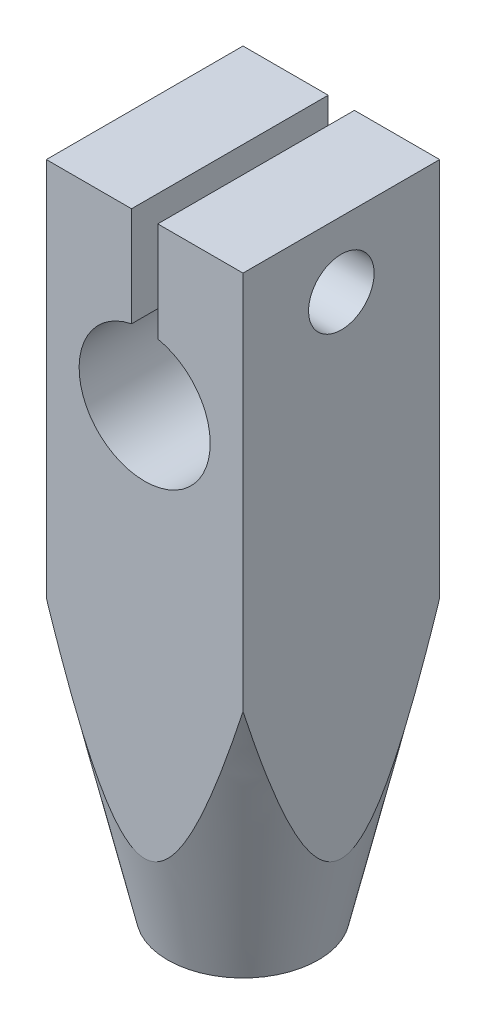
ISO-10303-21;
HEADER;
FILE_DESCRIPTION(('STEP AP214'),'2;1');
FILE_NAME('part.step','',(''),(''),'','','');
FILE_SCHEMA(('AUTOMOTIVE_DESIGN { 1 0 10303 214 1 1 1 1 }'));
ENDSEC;
DATA;
#1=APPLICATION_CONTEXT('core data for automotive mechanical design processes');
#2=APPLICATION_PROTOCOL_DEFINITION('international standard','automotive_design',2000,#1);
#3=PRODUCT_CONTEXT('',#1,'mechanical');
#4=PRODUCT('Part','Part','',(#3));
#5=PRODUCT_RELATED_PRODUCT_CATEGORY('part','',(#4));
#6=PRODUCT_DEFINITION_FORMATION('','',#4);
#7=PRODUCT_DEFINITION_CONTEXT('part definition',#1,'design');
#8=PRODUCT_DEFINITION('design','',#6,#7);
#9=PRODUCT_DEFINITION_SHAPE('','',#8);
#10=(LENGTH_UNIT() NAMED_UNIT(*) SI_UNIT(.MILLI.,.METRE.));
#11=(NAMED_UNIT(*) PLANE_ANGLE_UNIT() SI_UNIT($,.RADIAN.));
#12=(NAMED_UNIT(*) SI_UNIT($,.STERADIAN.) SOLID_ANGLE_UNIT());
#13=UNCERTAINTY_MEASURE_WITH_UNIT(LENGTH_MEASURE(1.E-05),#10,'distance_accuracy_value','');
#14=(GEOMETRIC_REPRESENTATION_CONTEXT(3) GLOBAL_UNCERTAINTY_ASSIGNED_CONTEXT((#13)) GLOBAL_UNIT_ASSIGNED_CONTEXT((#10,
#11,#12)) REPRESENTATION_CONTEXT('',''));
#15=CARTESIAN_POINT('',(0.,0.,0.));
#16=DIRECTION('',(0.,0.,1.));
#17=DIRECTION('',(1.,0.,0.));
#18=AXIS2_PLACEMENT_3D('',#15,#16,#17);
#19=CARTESIAN_POINT('',(-3.,205.,3.));
#20=DIRECTION('',(0.,-1.,0.));
#21=DIRECTION('',(0.,0.,-1.));
#22=AXIS2_PLACEMENT_3D('',#19,#20,#21);
#23=PLANE('',#22);
#24=DIRECTION('',(-1.,0.,0.));
#25=VECTOR('',#24,1.);
#26=CARTESIAN_POINT('',(-3.,205.,3.));
#27=LINE('',#26,#25);
#28=CARTESIAN_POINT('',(-0.400000000000001,205.,3.));
#29=VERTEX_POINT('',#28);
#30=CARTESIAN_POINT('',(-3.,205.,3.));
#31=VERTEX_POINT('',#30);
#32=EDGE_CURVE('E124',#29,#31,#27,.T.);
#33=ORIENTED_EDGE('',*,*,#32,.F.);
#34=DIRECTION('',(0.,0.,1.));
#35=VECTOR('',#34,1.);
#36=CARTESIAN_POINT('',(-0.400000000000001,205.,-3.58548068095813));
#37=LINE('',#36,#35);
#38=CARTESIAN_POINT('',(-0.400000000000001,205.,-3.));
#39=VERTEX_POINT('',#38);
#40=EDGE_CURVE('E116',#39,#29,#37,.T.);
#41=ORIENTED_EDGE('',*,*,#40,.F.);
#42=DIRECTION('',(-1.,0.,0.));
#43=VECTOR('',#42,1.);
#44=CARTESIAN_POINT('',(-3.,205.,-3.));
#45=LINE('',#44,#43);
#46=CARTESIAN_POINT('',(-3.,205.,-3.));
#47=VERTEX_POINT('',#46);
#48=EDGE_CURVE('E138',#39,#47,#45,.T.);
#49=ORIENTED_EDGE('',*,*,#48,.T.);
#50=DIRECTION('',(0.,0.,-1.));
#51=VECTOR('',#50,1.);
#52=CARTESIAN_POINT('',(-3.,205.,3.));
#53=LINE('',#52,#51);
#54=EDGE_CURVE('E123',#31,#47,#53,.T.);
#55=ORIENTED_EDGE('',*,*,#54,.F.);
#56=EDGE_LOOP('',(#33,#41,#49,#55));
#57=FACE_BOUND('',#56,.T.);
#58=ADVANCED_FACE('F35',(#57),#23,.F.);
#59=CARTESIAN_POINT('',(0.,0.,3.));
#60=DIRECTION('',(0.,0.,1.));
#61=DIRECTION('',(1.,0.,0.));
#62=AXIS2_PLACEMENT_3D('',#59,#60,#61);
#63=PLANE('',#62);
#64=DIRECTION('',(0.,-1.,0.));
#65=VECTOR('',#64,1.);
#66=CARTESIAN_POINT('',(-0.400000000000001,205.,3.));
#67=LINE('',#66,#65);
#68=CARTESIAN_POINT('',(-0.399999999999996,201.959591794227,3.));
#69=VERTEX_POINT('',#68);
#70=EDGE_CURVE('E59',#29,#69,#67,.T.);
#71=ORIENTED_EDGE('',*,*,#70,.F.);
#72=ORIENTED_EDGE('',*,*,#32,.T.);
#73=DIRECTION('',(0.,-1.,0.));
#74=VECTOR('',#73,1.);
#75=CARTESIAN_POINT('',(-3.,205.,3.));
#76=LINE('',#75,#74);
#77=CARTESIAN_POINT('',(-2.99999999999999,193.41450126866,3.));
#78=VERTEX_POINT('',#77);
#79=EDGE_CURVE('E139',#31,#78,#76,.T.);
#80=ORIENTED_EDGE('',*,*,#79,.T.);
#81=CARTESIAN_POINT('',(-9.01287451142703,216.182501373795,3.));
#82=CARTESIAN_POINT('',(-8.86165127865391,215.561028705235,3.));
#83=CARTESIAN_POINT('',(-8.71007949873085,214.939640636726,3.));
#84=CARTESIAN_POINT('',(-8.4060968737982,213.69706770407,3.));
#85=CARTESIAN_POINT('',(-8.25368602611668,213.075882840577,3.));
#86=CARTESIAN_POINT('',(-7.94774960641446,211.833207350189,3.));
#87=CARTESIAN_POINT('',(-7.7942231709233,211.21171693577,3.));
#88=CARTESIAN_POINT('',(-7.48600094126805,209.969027446211,3.));
#89=CARTESIAN_POINT('',(-7.33130514965128,209.34782837044,3.));
#90=CARTESIAN_POINT('',(-7.01741923952769,208.093445670033,3.));
#91=CARTESIAN_POINT('',(-6.85820088662912,207.460269105991,3.));
#92=CARTESIAN_POINT('',(-6.53797053455288,206.194369808065,3.));
#93=CARTESIAN_POINT('',(-6.37695853670778,205.561647073843,3.));
#94=CARTESIAN_POINT('',(-6.05283248344599,204.297300160195,3.));
#95=CARTESIAN_POINT('',(-5.88972028650205,203.665675504795,3.));
#96=CARTESIAN_POINT('',(-5.56066090324309,202.403177551625,3.));
#97=CARTESIAN_POINT('',(-5.39471377548291,201.772304238624,3.));
#98=CARTESIAN_POINT('',(-5.09683944336999,200.65329176169,3.));
#99=CARTESIAN_POINT('',(-4.9656531273945,200.164955578698,3.));
#100=CARTESIAN_POINT('',(-4.70046296670573,199.189013132647,3.));
#101=CARTESIAN_POINT('',(-4.56645893772648,198.701406919572,3.));
#102=CARTESIAN_POINT('',(-4.29452561978227,197.726070097895,3.));
#103=CARTESIAN_POINT('',(-4.15658795921019,197.23834181631,3.));
#104=CARTESIAN_POINT('',(-3.87592663379815,196.26437905762,3.));
#105=CARTESIAN_POINT('',(-3.73320404598431,195.778144270892,3.));
#106=CARTESIAN_POINT('',(-3.44252154652239,194.812238547251,3.));
#107=CARTESIAN_POINT('',(-3.29462394406386,194.33254902747,3.));
#108=CARTESIAN_POINT('',(-3.06558536957454,193.615075940682,3.));
#109=CARTESIAN_POINT('',(-2.98800472977996,193.376157011606,3.));
#110=CARTESIAN_POINT('',(-2.82986683715412,192.899317800469,3.));
#111=CARTESIAN_POINT('',(-2.74930974944097,192.661397463824,3.));
#112=CARTESIAN_POINT('',(-2.58476087229684,192.187852869738,3.));
#113=CARTESIAN_POINT('',(-2.50078481549463,191.952223174129,3.));
#114=CARTESIAN_POINT('',(-2.3278975916621,191.482712983951,3.));
#115=CARTESIAN_POINT('',(-2.23898529254675,191.248832904714,3.));
#116=CARTESIAN_POINT('',(-2.05461121333346,190.784032641517,3.));
#117=CARTESIAN_POINT('',(-1.9591594701316,190.553108539764,3.));
#118=CARTESIAN_POINT('',(-1.80872487133761,190.209953547973,3.));
#119=CARTESIAN_POINT('',(-1.75738117522927,190.096128853328,3.));
#120=CARTESIAN_POINT('',(-1.65166277099906,189.869900305202,3.));
#121=CARTESIAN_POINT('',(-1.5972884536239,189.757496270834,3.));
#122=CARTESIAN_POINT('',(-1.51713842542016,189.598879781359,3.));
#123=CARTESIAN_POINT('',(-1.49294703998735,189.551865605888,3.));
#124=CARTESIAN_POINT('',(-1.44378178526353,189.458244907353,3.));
#125=CARTESIAN_POINT('',(-1.4188078668044,189.411638410141,3.));
#126=CARTESIAN_POINT('',(-1.34254228970733,189.27247537057,3.));
#127=CARTESIAN_POINT('',(-1.28993427011471,189.180630200503,3.));
#128=CARTESIAN_POINT('',(-1.18009176724492,188.999494276551,3.));
#129=CARTESIAN_POINT('',(-1.12284886635755,188.910208587961,3.));
#130=CARTESIAN_POINT('',(-1.00229510043742,188.735871126595,3.));
#131=CARTESIAN_POINT('',(-0.938990933958253,188.650814834195,3.));
#132=CARTESIAN_POINT('',(-0.803008187582504,188.486436463202,3.));
#133=CARTESIAN_POINT('',(-0.73021003176836,188.407212127979,3.));
#134=CARTESIAN_POINT('',(-0.572357849866844,188.26223165786,3.));
#135=CARTESIAN_POINT('',(-0.487421956491983,188.196359013203,3.));
#136=CARTESIAN_POINT('',(-0.356238912029505,188.122304082717,3.));
#137=CARTESIAN_POINT('',(-0.316438691850352,188.10292024724,3.));
#138=CARTESIAN_POINT('',(-0.234336687293959,188.070413642556,3.));
#139=CARTESIAN_POINT('',(-0.192037744603792,188.057283909248,3.));
#140=CARTESIAN_POINT('',(-0.10528022130079,188.038670553009,3.));
#141=CARTESIAN_POINT('',(-0.060804102616985,188.033265741773,3.));
#142=CARTESIAN_POINT('',(0.0283584576351706,188.031180465067,3.));
#143=CARTESIAN_POINT('',(0.0730448694952927,188.034498802142,3.));
#144=CARTESIAN_POINT('',(0.156028177442846,188.048493531718,3.));
#145=CARTESIAN_POINT('',(0.194478951566063,188.058301518907,3.));
#146=CARTESIAN_POINT('',(0.269538368709179,188.083367098795,3.));
#147=CARTESIAN_POINT('',(0.306145915900473,188.098627890632,3.));
#148=CARTESIAN_POINT('',(0.403007581213953,188.146095063985,3.));
#149=CARTESIAN_POINT('',(0.461152416395532,188.182563570171,3.));
#150=CARTESIAN_POINT('',(0.571484021358029,188.263595271081,3.));
#151=CARTESIAN_POINT('',(0.623648930970702,188.308186713162,3.));
#152=CARTESIAN_POINT('',(0.742934425000127,188.421325672918,3.));
#153=CARTESIAN_POINT('',(0.807696117993594,188.492323275336,3.));
#154=CARTESIAN_POINT('',(0.930317531107682,188.640120648052,3.));
#155=CARTESIAN_POINT('',(0.988161030668625,188.71693339037,3.));
#156=CARTESIAN_POINT('',(1.09902342909704,188.874688114438,3.));
#157=CARTESIAN_POINT('',(1.15200793009996,188.955654023179,3.));
#158=CARTESIAN_POINT('',(1.25391236781289,189.119944605941,3.));
#159=CARTESIAN_POINT('',(1.30283693201381,189.20326644525,3.));
#160=CARTESIAN_POINT('',(1.4026005741772,189.38061538266,3.));
#161=CARTESIAN_POINT('',(1.4530895668492,189.474838306108,3.));
#162=CARTESIAN_POINT('',(1.55106094056043,189.664840538209,3.));
#163=CARTESIAN_POINT('',(1.59854286065923,189.760620082655,3.));
#164=CARTESIAN_POINT('',(1.73743176100008,190.049795449297,3.));
#165=CARTESIAN_POINT('',(1.82522521910847,190.244923701157,3.));
#166=CARTESIAN_POINT('',(1.99439311233377,190.638466096465,3.));
#167=CARTESIAN_POINT('',(2.07575111054076,190.836887181287,3.));
#168=CARTESIAN_POINT('',(2.23354308611966,191.235594988893,3.));
#169=CARTESIAN_POINT('',(2.30997865638071,191.435881083904,3.));
#170=CARTESIAN_POINT('',(2.45922107007001,191.838126167329,3.));
#171=CARTESIAN_POINT('',(2.53202243670159,192.040087175732,3.));
#172=CARTESIAN_POINT('',(2.67467387364262,192.445063460558,3.));
#173=CARTESIAN_POINT('',(2.74452371022694,192.648078819048,3.));
#174=CARTESIAN_POINT('',(2.88173091845588,193.05460503559,3.));
#175=CARTESIAN_POINT('',(2.94909190861685,193.258114675652,3.));
#176=CARTESIAN_POINT('',(3.08184582557207,193.665766278906,3.));
#177=CARTESIAN_POINT('',(3.14723881409911,193.86990822204,3.));
#178=CARTESIAN_POINT('',(3.34175953676816,194.485618571445,3.));
#179=CARTESIAN_POINT('',(3.46839573242425,194.89797404847,3.));
#180=CARTESIAN_POINT('',(3.71687360351173,195.724130395756,3.));
#181=CARTESIAN_POINT('',(3.83871514120677,196.137931307168,3.));
#182=CARTESIAN_POINT('',(4.0787647797307,196.966625871803,3.));
#183=CARTESIAN_POINT('',(4.19697253792434,197.381519624092,3.));
#184=CARTESIAN_POINT('',(4.43053752667301,198.212109747289,3.));
#185=CARTESIAN_POINT('',(4.54589473739377,198.627806123761,3.));
#186=CARTESIAN_POINT('',(4.88882619965151,199.876716791018,3.));
#187=CARTESIAN_POINT('',(5.11300550019374,200.710862688925,3.));
#188=CARTESIAN_POINT('',(5.55528745513385,202.38070609231,3.));
#189=CARTESIAN_POINT('',(5.77339043983136,203.216403510805,3.));
#190=CARTESIAN_POINT('',(6.19794633479018,204.8606324277,3.));
#191=CARTESIAN_POINT('',(6.40454376984558,205.669126660005,3.));
#192=CARTESIAN_POINT('',(6.81470400392408,207.286898732689,3.));
#193=CARTESIAN_POINT('',(7.01826674824796,208.096176586914,3.));
#194=CARTESIAN_POINT('',(7.42273971113844,209.714048015297,3.));
#195=CARTESIAN_POINT('',(7.62365358371652,210.522640676984,3.));
#196=CARTESIAN_POINT('',(8.0236128024546,212.140267690671,3.));
#197=CARTESIAN_POINT('',(8.22265819311678,212.949302031662,3.));
#198=CARTESIAN_POINT('',(8.42100402595839,213.758506656645,3.));
#199=B_SPLINE_CURVE_WITH_KNOTS('',3,(#81,#82,#83,#84,#85,#86,#87,#88,#89,#90,#91,#92,#93,#94,
#95,#96,#97,#98,#99,#100,#101,#102,#103,#104,#105,#106,#107,#108,#109,#110,#111,#112,#113,#114,
#115,#116,#117,#118,#119,#120,#121,#122,#123,#124,#125,#126,#127,#128,#129,#130,#131,#132,#133,
#134,#135,#136,#137,#138,#139,#140,#141,#142,#143,#144,#145,#146,#147,#148,#149,#150,#151,#152,
#153,#154,#155,#156,#157,#158,#159,#160,#161,#162,#163,#164,#165,#166,#167,#168,#169,#170,#171,
#172,#173,#174,#175,#176,#177,#178,#179,#180,#181,#182,#183,#184,#185,#186,#187,#188,#189,#190,
#191,#192,#193,#194,#195,#196,#197,#198),.UNSPECIFIED.,.F.,.F.,(4,2,2,2,2,2,2,2,2,2,2,2,2,2,2,2,
2,2,2,2,2,2,2,2,2,2,2,2,2,2,2,2,2,2,2,2,2,2,2,2,2,2,2,2,2,2,2,2,2,2,2,2,2,2,2,2,2,2,4),(0.,
1.91882033734962,3.8376467885473,5.75816303129035,7.67867509159152,9.63733769750928,
11.5959988483415,13.5530319597337,15.5100246978287,17.0269687028606,18.5440122197657,
20.0645689722607,21.5847857348223,23.0906228492239,23.8442054575271,24.5977463235007,
25.3481432500048,26.0987129903292,26.8481554862079,27.2227313801459,27.5972590901563,
27.755871626447,27.9144941487475,28.2319233042748,28.5499424761587,28.8676141617667,
29.18976427265,29.5089691602306,29.641372622476,29.7736283034432,29.9072238893125,
30.0408011370316,30.1593735853673,30.2780157141819,30.4827185288887,30.6881472759592,
30.9757074263417,31.2639291021708,31.5540548893247,31.8438453161143,32.1644665969548,
32.485136906003,33.1268331585943,33.770118736513,34.413195091339,35.0572129961698,
35.7012818041445,36.3443740704246,36.9874461429483,38.2814876372858,39.5755662785145,
40.8697665686564,42.163975861383,44.7551713246127,47.3462256583361,49.8496370204633,
52.3530934512606,54.8526302588768,57.3521073824788),.UNSPECIFIED.);
#200=CARTESIAN_POINT('',(3.,193.41450126866,3.));
#201=VERTEX_POINT('',#200);
#202=EDGE_CURVE('E193',#201,#78,#199,.F.);
#203=ORIENTED_EDGE('',*,*,#202,.F.);
#204=DIRECTION('',(0.,1.,0.));
#205=VECTOR('',#204,1.);
#206=CARTESIAN_POINT('',(3.,205.,3.));
#207=LINE('',#206,#205);
#208=CARTESIAN_POINT('',(3.,205.,3.));
#209=VERTEX_POINT('',#208);
#210=EDGE_CURVE('E121',#201,#209,#207,.T.);
#211=ORIENTED_EDGE('',*,*,#210,.T.);
#212=CARTESIAN_POINT('',(0.400000000000001,205.,3.));
#213=VERTEX_POINT('',#212);
#214=EDGE_CURVE('E113',#209,#213,#27,.T.);
#215=ORIENTED_EDGE('',*,*,#214,.T.);
#216=DIRECTION('',(0.,1.,0.));
#217=VECTOR('',#216,1.);
#218=CARTESIAN_POINT('',(0.400000000000001,205.,3.));
#219=LINE('',#218,#217);
#220=CARTESIAN_POINT('',(0.400000000000002,201.959591794227,3.));
#221=VERTEX_POINT('',#220);
#222=EDGE_CURVE('E99',#221,#213,#219,.T.);
#223=ORIENTED_EDGE('',*,*,#222,.F.);
#224=CARTESIAN_POINT('',(0.,200.,3.));
#225=DIRECTION('',(0.,0.,1.));
#226=DIRECTION('',(1.,0.,0.));
#227=AXIS2_PLACEMENT_3D('',#224,#225,#226);
#228=CIRCLE('',#227,2.);
#229=EDGE_CURVE('E136',#69,#221,#228,.T.);
#230=ORIENTED_EDGE('',*,*,#229,.F.);
#231=EDGE_LOOP('',(#71,#72,#80,#203,#211,#215,#223,#230));
#232=FACE_BOUND('',#231,.T.);
#233=ADVANCED_FACE('F118',(#232),#63,.T.);
#234=CARTESIAN_POINT('',(0.,0.,-3.));
#235=DIRECTION('',(0.,0.,1.));
#236=DIRECTION('',(1.,0.,0.));
#237=AXIS2_PLACEMENT_3D('',#234,#235,#236);
#238=PLANE('',#237);
#239=ORIENTED_EDGE('',*,*,#48,.F.);
#240=DIRECTION('',(0.,-1.,0.));
#241=VECTOR('',#240,1.);
#242=CARTESIAN_POINT('',(-0.400000000000001,0.,-3.));
#243=LINE('',#242,#241);
#244=CARTESIAN_POINT('',(-0.400000000000001,201.959591794227,-3.));
#245=VERTEX_POINT('',#244);
#246=EDGE_CURVE('E235',#39,#245,#243,.T.);
#247=ORIENTED_EDGE('',*,*,#246,.T.);
#248=CARTESIAN_POINT('',(0.,200.,-3.));
#249=DIRECTION('',(0.,0.,1.));
#250=DIRECTION('',(1.,0.,0.));
#251=AXIS2_PLACEMENT_3D('',#248,#249,#250);
#252=CIRCLE('',#251,2.);
#253=CARTESIAN_POINT('',(0.4,201.959591794227,-3.));
#254=VERTEX_POINT('',#253);
#255=EDGE_CURVE('E213',#245,#254,#252,.T.);
#256=ORIENTED_EDGE('',*,*,#255,.T.);
#257=DIRECTION('',(0.,1.,0.));
#258=VECTOR('',#257,1.);
#259=CARTESIAN_POINT('',(0.400000000000075,0.,-3.));
#260=LINE('',#259,#258);
#261=CARTESIAN_POINT('',(0.400000000000001,205.,-3.));
#262=VERTEX_POINT('',#261);
#263=EDGE_CURVE('E52',#254,#262,#260,.T.);
#264=ORIENTED_EDGE('',*,*,#263,.T.);
#265=CARTESIAN_POINT('',(3.,205.,-3.));
#266=VERTEX_POINT('',#265);
#267=EDGE_CURVE('E115',#266,#262,#45,.T.);
#268=ORIENTED_EDGE('',*,*,#267,.F.);
#269=DIRECTION('',(0.,1.,0.));
#270=VECTOR('',#269,1.);
#271=CARTESIAN_POINT('',(3.,205.,-3.));
#272=LINE('',#271,#270);
#273=CARTESIAN_POINT('',(3.,193.41450126866,-3.));
#274=VERTEX_POINT('',#273);
#275=EDGE_CURVE('E135',#274,#266,#272,.T.);
#276=ORIENTED_EDGE('',*,*,#275,.F.);
#277=CARTESIAN_POINT('',(-9.01287451142703,216.182501373795,-3.));
#278=CARTESIAN_POINT('',(-8.86165127865391,215.561028705235,-3.));
#279=CARTESIAN_POINT('',(-8.71007949873085,214.939640636726,-3.));
#280=CARTESIAN_POINT('',(-8.4060968737982,213.69706770407,-3.));
#281=CARTESIAN_POINT('',(-8.25368602611668,213.075882840577,-3.));
#282=CARTESIAN_POINT('',(-7.94774960641446,211.833207350189,-3.));
#283=CARTESIAN_POINT('',(-7.7942231709233,211.21171693577,-3.));
#284=CARTESIAN_POINT('',(-7.48600094126805,209.969027446211,-3.));
#285=CARTESIAN_POINT('',(-7.33130514965128,209.34782837044,-3.));
#286=CARTESIAN_POINT('',(-7.01741923952769,208.093445670033,-3.));
#287=CARTESIAN_POINT('',(-6.85820088662912,207.460269105991,-3.));
#288=CARTESIAN_POINT('',(-6.53797053455288,206.194369808065,-3.));
#289=CARTESIAN_POINT('',(-6.37695853670778,205.561647073843,-3.));
#290=CARTESIAN_POINT('',(-6.05283248344599,204.297300160195,-3.));
#291=CARTESIAN_POINT('',(-5.88972028650205,203.665675504795,-3.));
#292=CARTESIAN_POINT('',(-5.56066090324309,202.403177551625,-3.));
#293=CARTESIAN_POINT('',(-5.39471377548291,201.772304238624,-3.));
#294=CARTESIAN_POINT('',(-5.09683944336999,200.65329176169,-3.));
#295=CARTESIAN_POINT('',(-4.9656531273945,200.164955578698,-3.));
#296=CARTESIAN_POINT('',(-4.70046296670573,199.189013132647,-3.));
#297=CARTESIAN_POINT('',(-4.56645893772648,198.701406919572,-3.));
#298=CARTESIAN_POINT('',(-4.29452561978227,197.726070097895,-3.));
#299=CARTESIAN_POINT('',(-4.15658795921019,197.23834181631,-3.));
#300=CARTESIAN_POINT('',(-3.87592663379815,196.26437905762,-3.));
#301=CARTESIAN_POINT('',(-3.73320404598431,195.778144270892,-3.));
#302=CARTESIAN_POINT('',(-3.44252154652239,194.812238547251,-3.));
#303=CARTESIAN_POINT('',(-3.29462394406386,194.33254902747,-3.));
#304=CARTESIAN_POINT('',(-3.06558536957454,193.615075940682,-3.));
#305=CARTESIAN_POINT('',(-2.98800472977996,193.376157011606,-3.));
#306=CARTESIAN_POINT('',(-2.82986683715412,192.899317800469,-3.));
#307=CARTESIAN_POINT('',(-2.74930974944097,192.661397463824,-3.));
#308=CARTESIAN_POINT('',(-2.58476087229684,192.187852869738,-3.));
#309=CARTESIAN_POINT('',(-2.50078481549463,191.952223174129,-3.));
#310=CARTESIAN_POINT('',(-2.3278975916621,191.482712983951,-3.));
#311=CARTESIAN_POINT('',(-2.23898529254675,191.248832904714,-3.));
#312=CARTESIAN_POINT('',(-2.05461121333346,190.784032641517,-3.));
#313=CARTESIAN_POINT('',(-1.9591594701316,190.553108539764,-3.));
#314=CARTESIAN_POINT('',(-1.80872487133761,190.209953547973,-3.));
#315=CARTESIAN_POINT('',(-1.75738117522927,190.096128853328,-3.));
#316=CARTESIAN_POINT('',(-1.65166277099906,189.869900305202,-3.));
#317=CARTESIAN_POINT('',(-1.5972884536239,189.757496270834,-3.));
#318=CARTESIAN_POINT('',(-1.51713842542016,189.598879781359,-3.));
#319=CARTESIAN_POINT('',(-1.49294703998735,189.551865605888,-3.));
#320=CARTESIAN_POINT('',(-1.44378178526353,189.458244907353,-3.));
#321=CARTESIAN_POINT('',(-1.4188078668044,189.411638410141,-3.));
#322=CARTESIAN_POINT('',(-1.34254228970733,189.27247537057,-3.));
#323=CARTESIAN_POINT('',(-1.28993427011471,189.180630200503,-3.));
#324=CARTESIAN_POINT('',(-1.18009176724492,188.999494276551,-3.));
#325=CARTESIAN_POINT('',(-1.12284886635755,188.910208587961,-3.));
#326=CARTESIAN_POINT('',(-1.00229510043742,188.735871126595,-3.));
#327=CARTESIAN_POINT('',(-0.938990933958253,188.650814834195,-3.));
#328=CARTESIAN_POINT('',(-0.803008187582504,188.486436463202,-3.));
#329=CARTESIAN_POINT('',(-0.73021003176836,188.407212127979,-3.));
#330=CARTESIAN_POINT('',(-0.572357849866844,188.26223165786,-3.));
#331=CARTESIAN_POINT('',(-0.487421956491983,188.196359013203,-3.));
#332=CARTESIAN_POINT('',(-0.356238912029505,188.122304082717,-3.));
#333=CARTESIAN_POINT('',(-0.316438691850352,188.10292024724,-3.));
#334=CARTESIAN_POINT('',(-0.234336687293959,188.070413642556,-3.));
#335=CARTESIAN_POINT('',(-0.192037744603792,188.057283909248,-3.));
#336=CARTESIAN_POINT('',(-0.10528022130079,188.038670553009,-3.));
#337=CARTESIAN_POINT('',(-0.060804102616985,188.033265741773,-3.));
#338=CARTESIAN_POINT('',(0.0283584576351706,188.031180465067,-3.));
#339=CARTESIAN_POINT('',(0.0730448694952927,188.034498802142,-3.));
#340=CARTESIAN_POINT('',(0.156028177442846,188.048493531718,-3.));
#341=CARTESIAN_POINT('',(0.194478951566063,188.058301518907,-3.));
#342=CARTESIAN_POINT('',(0.269538368709179,188.083367098795,-3.));
#343=CARTESIAN_POINT('',(0.306145915900473,188.098627890632,-3.));
#344=CARTESIAN_POINT('',(0.403007581213953,188.146095063985,-3.));
#345=CARTESIAN_POINT('',(0.461152416395532,188.182563570171,-3.));
#346=CARTESIAN_POINT('',(0.571484021358029,188.263595271081,-3.));
#347=CARTESIAN_POINT('',(0.623648930970702,188.308186713162,-3.));
#348=CARTESIAN_POINT('',(0.742934425000127,188.421325672918,-3.));
#349=CARTESIAN_POINT('',(0.807696117993594,188.492323275336,-3.));
#350=CARTESIAN_POINT('',(0.930317531107682,188.640120648052,-3.));
#351=CARTESIAN_POINT('',(0.988161030668625,188.71693339037,-3.));
#352=CARTESIAN_POINT('',(1.09902342909704,188.874688114438,-3.));
#353=CARTESIAN_POINT('',(1.15200793009996,188.955654023179,-3.));
#354=CARTESIAN_POINT('',(1.25391236781289,189.119944605941,-3.));
#355=CARTESIAN_POINT('',(1.30283693201381,189.20326644525,-3.));
#356=CARTESIAN_POINT('',(1.4026005741772,189.38061538266,-3.));
#357=CARTESIAN_POINT('',(1.4530895668492,189.474838306108,-3.));
#358=CARTESIAN_POINT('',(1.55106094056043,189.664840538209,-3.));
#359=CARTESIAN_POINT('',(1.59854286065923,189.760620082655,-3.));
#360=CARTESIAN_POINT('',(1.73743176100008,190.049795449297,-3.));
#361=CARTESIAN_POINT('',(1.82522521910847,190.244923701157,-3.));
#362=CARTESIAN_POINT('',(1.99439311233377,190.638466096465,-3.));
#363=CARTESIAN_POINT('',(2.07575111054076,190.836887181287,-3.));
#364=CARTESIAN_POINT('',(2.23354308611966,191.235594988893,-3.));
#365=CARTESIAN_POINT('',(2.30997865638071,191.435881083904,-3.));
#366=CARTESIAN_POINT('',(2.45922107007001,191.838126167329,-3.));
#367=CARTESIAN_POINT('',(2.53202243670159,192.040087175732,-3.));
#368=CARTESIAN_POINT('',(2.67467387364262,192.445063460558,-3.));
#369=CARTESIAN_POINT('',(2.74452371022694,192.648078819048,-3.));
#370=CARTESIAN_POINT('',(2.88173091845588,193.05460503559,-3.));
#371=CARTESIAN_POINT('',(2.94909190861685,193.258114675652,-3.));
#372=CARTESIAN_POINT('',(3.08184582557207,193.665766278906,-3.));
#373=CARTESIAN_POINT('',(3.14723881409911,193.86990822204,-3.));
#374=CARTESIAN_POINT('',(3.34175953676816,194.485618571445,-3.));
#375=CARTESIAN_POINT('',(3.46839573242425,194.89797404847,-3.));
#376=CARTESIAN_POINT('',(3.71687360351173,195.724130395756,-3.));
#377=CARTESIAN_POINT('',(3.83871514120677,196.137931307168,-3.));
#378=CARTESIAN_POINT('',(4.0787647797307,196.966625871803,-3.));
#379=CARTESIAN_POINT('',(4.19697253792434,197.381519624092,-3.));
#380=CARTESIAN_POINT('',(4.43053752667301,198.212109747289,-3.));
#381=CARTESIAN_POINT('',(4.54589473739377,198.627806123761,-3.));
#382=CARTESIAN_POINT('',(4.88882619965151,199.876716791018,-3.));
#383=CARTESIAN_POINT('',(5.11300550019374,200.710862688925,-3.));
#384=CARTESIAN_POINT('',(5.55528745513385,202.38070609231,-3.));
#385=CARTESIAN_POINT('',(5.77339043983136,203.216403510805,-3.));
#386=CARTESIAN_POINT('',(6.19794633479018,204.8606324277,-3.));
#387=CARTESIAN_POINT('',(6.40454376984558,205.669126660005,-3.));
#388=CARTESIAN_POINT('',(6.81470400392408,207.286898732689,-3.));
#389=CARTESIAN_POINT('',(7.01826674824796,208.096176586914,-3.));
#390=CARTESIAN_POINT('',(7.42273971113844,209.714048015297,-3.));
#391=CARTESIAN_POINT('',(7.62365358371652,210.522640676984,-3.));
#392=CARTESIAN_POINT('',(8.0236128024546,212.140267690671,-3.));
#393=CARTESIAN_POINT('',(8.22265819311678,212.949302031662,-3.));
#394=CARTESIAN_POINT('',(8.42100402595839,213.758506656645,-3.));
#395=B_SPLINE_CURVE_WITH_KNOTS('',3,(#277,#278,#279,#280,#281,#282,#283,#284,#285,#286,#287,
#288,#289,#290,#291,#292,#293,#294,#295,#296,#297,#298,#299,#300,#301,#302,#303,#304,#305,#306,
#307,#308,#309,#310,#311,#312,#313,#314,#315,#316,#317,#318,#319,#320,#321,#322,#323,#324,#325,
#326,#327,#328,#329,#330,#331,#332,#333,#334,#335,#336,#337,#338,#339,#340,#341,#342,#343,#344,
#345,#346,#347,#348,#349,#350,#351,#352,#353,#354,#355,#356,#357,#358,#359,#360,#361,#362,#363,
#364,#365,#366,#367,#368,#369,#370,#371,#372,#373,#374,#375,#376,#377,#378,#379,#380,#381,#382,
#383,#384,#385,#386,#387,#388,#389,#390,#391,#392,#393,#394),.UNSPECIFIED.,.F.,.F.,(4,2,2,2,2,2,
2,2,2,2,2,2,2,2,2,2,2,2,2,2,2,2,2,2,2,2,2,2,2,2,2,2,2,2,2,2,2,2,2,2,2,2,2,2,2,2,2,2,2,2,2,2,2,2,
2,2,2,2,4),(0.,1.91882033734962,3.8376467885473,5.75816303129035,7.67867509159152,
9.63733769750928,11.5959988483415,13.5530319597337,15.5100246978287,17.0269687028606,
18.5440122197657,20.0645689722607,21.5847857348223,23.0906228492239,23.8442054575271,
24.5977463235007,25.3481432500048,26.0987129903292,26.8481554862079,27.2227313801459,
27.5972590901563,27.755871626447,27.9144941487475,28.2319233042748,28.5499424761587,
28.8676141617667,29.18976427265,29.5089691602306,29.641372622476,29.7736283034432,
29.9072238893125,30.0408011370316,30.1593735853673,30.2780157141819,30.4827185288887,
30.6881472759592,30.9757074263417,31.2639291021708,31.5540548893247,31.8438453161143,
32.1644665969548,32.485136906003,33.1268331585943,33.770118736513,34.413195091339,
35.0572129961698,35.7012818041445,36.3443740704246,36.9874461429483,38.2814876372858,
39.5755662785145,40.8697665686564,42.163975861383,44.7551713246127,47.3462256583361,
49.8496370204633,52.3530934512606,54.8526302588768,57.3521073824788),.UNSPECIFIED.);
#396=CARTESIAN_POINT('',(-2.99999999999999,193.41450126866,-3.));
#397=VERTEX_POINT('',#396);
#398=EDGE_CURVE('E201',#274,#397,#395,.F.);
#399=ORIENTED_EDGE('',*,*,#398,.T.);
#400=DIRECTION('',(0.,-1.,0.));
#401=VECTOR('',#400,1.);
#402=CARTESIAN_POINT('',(-3.,205.,-3.));
#403=LINE('',#402,#401);
#404=EDGE_CURVE('E132',#47,#397,#403,.T.);
#405=ORIENTED_EDGE('',*,*,#404,.F.);
#406=EDGE_LOOP('',(#239,#247,#256,#264,#268,#276,#399,#405));
#407=FACE_BOUND('',#406,.T.);
#408=ADVANCED_FACE('F180',(#407),#238,.F.);
#409=CARTESIAN_POINT('',(-3.,205.,3.));
#410=DIRECTION('',(1.,0.,0.));
#411=DIRECTION('',(0.,1.,0.));
#412=AXIS2_PLACEMENT_3D('',#409,#410,#411);
#413=PLANE('',#412);
#414=CARTESIAN_POINT('',(-3.,203.,0.));
#415=DIRECTION('',(1.,0.,0.));
#416=DIRECTION('',(0.,1.,0.));
#417=AXIS2_PLACEMENT_3D('',#414,#415,#416);
#418=CIRCLE('',#417,1.);
#419=CARTESIAN_POINT('',(-3.,204.,0.));
#420=VERTEX_POINT('',#419);
#421=EDGE_CURVE('E242',#420,#420,#418,.T.);
#422=ORIENTED_EDGE('',*,*,#421,.T.);
#423=EDGE_LOOP('',(#422));
#424=FACE_BOUND('',#423,.T.);
#425=ORIENTED_EDGE('',*,*,#404,.T.);
#426=CARTESIAN_POINT('',(-3.,216.182501373795,-9.01287451142703));
#427=CARTESIAN_POINT('',(-3.,215.561028705235,-8.86165127865391));
#428=CARTESIAN_POINT('',(-3.,214.939640636726,-8.71007949873086));
#429=CARTESIAN_POINT('',(-3.,213.69706770407,-8.40609687379821));
#430=CARTESIAN_POINT('',(-3.,213.075882840577,-8.25368602611668));
#431=CARTESIAN_POINT('',(-3.,211.833207350189,-7.94774960641446));
#432=CARTESIAN_POINT('',(-3.,211.21171693577,-7.7942231709233));
#433=CARTESIAN_POINT('',(-3.,209.969027446211,-7.48600094126806));
#434=CARTESIAN_POINT('',(-3.,209.34782837044,-7.33130514965129));
#435=CARTESIAN_POINT('',(-3.,208.093445670033,-7.01741923952769));
#436=CARTESIAN_POINT('',(-3.,207.460269105991,-6.85820088662912));
#437=CARTESIAN_POINT('',(-3.,206.194369808065,-6.53797053455287));
#438=CARTESIAN_POINT('',(-3.,205.561647073843,-6.37695853670778));
#439=CARTESIAN_POINT('',(-3.,204.297300160195,-6.05283248344599));
#440=CARTESIAN_POINT('',(-3.,203.665675504795,-5.88972028650205));
#441=CARTESIAN_POINT('',(-3.,202.403177551625,-5.56066090324309));
#442=CARTESIAN_POINT('',(-3.,201.772304238624,-5.39471377548291));
#443=CARTESIAN_POINT('',(-3.,200.65329176169,-5.09683944337));
#444=CARTESIAN_POINT('',(-3.,200.164955578698,-4.9656531273945));
#445=CARTESIAN_POINT('',(-3.,199.189013132647,-4.70046296670573));
#446=CARTESIAN_POINT('',(-3.,198.701406919572,-4.56645893772647));
#447=CARTESIAN_POINT('',(-3.,197.726070097895,-4.29452561978226));
#448=CARTESIAN_POINT('',(-3.,197.23834181631,-4.15658795921018));
#449=CARTESIAN_POINT('',(-3.,196.26437905762,-3.87592663379814));
#450=CARTESIAN_POINT('',(-3.,195.778144270892,-3.7332040459843));
#451=CARTESIAN_POINT('',(-3.,194.812238547251,-3.44252154652237));
#452=CARTESIAN_POINT('',(-3.,194.33254902747,-3.29462394406384));
#453=CARTESIAN_POINT('',(-3.,193.615075940682,-3.06558536957452));
#454=CARTESIAN_POINT('',(-3.,193.376157011606,-2.98800472977995));
#455=CARTESIAN_POINT('',(-3.,192.899317800469,-2.8298668371541));
#456=CARTESIAN_POINT('',(-3.,192.661397463824,-2.74930974944096));
#457=CARTESIAN_POINT('',(-3.,192.187852869738,-2.58476087229684));
#458=CARTESIAN_POINT('',(-3.,191.952223174129,-2.50078481549462));
#459=CARTESIAN_POINT('',(-3.,191.482712983951,-2.32789759166209));
#460=CARTESIAN_POINT('',(-3.,191.248832904714,-2.23898529254674));
#461=CARTESIAN_POINT('',(-3.,190.784032641517,-2.05461121333345));
#462=CARTESIAN_POINT('',(-3.,190.553108539764,-1.9591594701316));
#463=CARTESIAN_POINT('',(-3.,190.209953547973,-1.80872487133759));
#464=CARTESIAN_POINT('',(-3.,190.096128853328,-1.75738117522925));
#465=CARTESIAN_POINT('',(-3.,189.869900305202,-1.65166277099905));
#466=CARTESIAN_POINT('',(-3.,189.757496270834,-1.59728845362391));
#467=CARTESIAN_POINT('',(-3.,189.598879781359,-1.51713842542017));
#468=CARTESIAN_POINT('',(-3.,189.551865605888,-1.49294703998735));
#469=CARTESIAN_POINT('',(-3.,189.458244907353,-1.44378178526353));
#470=CARTESIAN_POINT('',(-3.,189.411638410141,-1.41880786680438));
#471=CARTESIAN_POINT('',(-3.,189.27247537057,-1.34254228970733));
#472=CARTESIAN_POINT('',(-3.,189.180630200503,-1.2899342701147));
#473=CARTESIAN_POINT('',(-3.,188.999494276551,-1.18009176724492));
#474=CARTESIAN_POINT('',(-3.,188.910208587961,-1.12284886635755));
#475=CARTESIAN_POINT('',(-3.,188.735871126595,-1.00229510043742));
#476=CARTESIAN_POINT('',(-3.,188.650814834195,-0.938990933958249));
#477=CARTESIAN_POINT('',(-3.,188.486436463202,-0.80300818758249));
#478=CARTESIAN_POINT('',(-3.,188.407212127979,-0.730210031768342));
#479=CARTESIAN_POINT('',(-3.,188.26223165786,-0.572357849866823));
#480=CARTESIAN_POINT('',(-3.,188.196359013203,-0.48742195649196));
#481=CARTESIAN_POINT('',(-3.,188.122304082717,-0.356238912029474));
#482=CARTESIAN_POINT('',(-3.,188.10292024724,-0.316438691850318));
#483=CARTESIAN_POINT('',(-3.,188.070413642556,-0.234336687293929));
#484=CARTESIAN_POINT('',(-3.,188.057283909248,-0.192037744603768));
#485=CARTESIAN_POINT('',(-3.,188.038670553009,-0.105280221300775));
#486=CARTESIAN_POINT('',(-3.,188.033265741773,-0.0608041026169741));
#487=CARTESIAN_POINT('',(-3.,188.031180465067,0.028358457635173));
#488=CARTESIAN_POINT('',(-3.,188.034498802142,0.07304486949529));
#489=CARTESIAN_POINT('',(-3.,188.048493531718,0.156028177442846));
#490=CARTESIAN_POINT('',(-3.,188.058301518907,0.19447895156607));
#491=CARTESIAN_POINT('',(-3.,188.083367098795,0.26953836870919));
#492=CARTESIAN_POINT('',(-3.,188.098627890632,0.306145915900481));
#493=CARTESIAN_POINT('',(-3.,188.146095063985,0.403007581213958));
#494=CARTESIAN_POINT('',(-3.,188.182563570171,0.461152416395542));
#495=CARTESIAN_POINT('',(-3.,188.263595271081,0.571484021358043));
#496=CARTESIAN_POINT('',(-3.,188.308186713162,0.623648930970715));
#497=CARTESIAN_POINT('',(-3.,188.421325672918,0.74293442500013));
#498=CARTESIAN_POINT('',(-3.,188.492323275336,0.807696117993589));
#499=CARTESIAN_POINT('',(-3.,188.640120648052,0.930317531107679));
#500=CARTESIAN_POINT('',(-3.,188.71693339037,0.988161030668628));
#501=CARTESIAN_POINT('',(-3.,188.874688114438,1.09902342909705));
#502=CARTESIAN_POINT('',(-3.,188.955654023179,1.15200793009998));
#503=CARTESIAN_POINT('',(-3.,189.119944605941,1.25391236781291));
#504=CARTESIAN_POINT('',(-3.,189.20326644525,1.30283693201384));
#505=CARTESIAN_POINT('',(-3.,189.38061538266,1.40260057417725));
#506=CARTESIAN_POINT('',(-3.,189.474838306108,1.45308956684926));
#507=CARTESIAN_POINT('',(-3.,189.664840538209,1.55106094056049));
#508=CARTESIAN_POINT('',(-3.,189.760620082655,1.59854286065929));
#509=CARTESIAN_POINT('',(-3.,190.049795449298,1.73743176100014));
#510=CARTESIAN_POINT('',(-3.,190.244923701157,1.82522521910852));
#511=CARTESIAN_POINT('',(-3.,190.638466096465,1.99439311233382));
#512=CARTESIAN_POINT('',(-3.,190.836887181287,2.07575111054082));
#513=CARTESIAN_POINT('',(-3.,191.235594988893,2.23354308611971));
#514=CARTESIAN_POINT('',(-3.,191.435881083904,2.30997865638076));
#515=CARTESIAN_POINT('',(-3.,191.83812616733,2.45922107007006));
#516=CARTESIAN_POINT('',(-3.,192.040087175733,2.53202243670164));
#517=CARTESIAN_POINT('',(-3.,192.445063460558,2.67467387364267));
#518=CARTESIAN_POINT('',(-3.,192.648078819048,2.74452371022699));
#519=CARTESIAN_POINT('',(-3.,193.05460503559,2.88173091845593));
#520=CARTESIAN_POINT('',(-3.,193.258114675653,2.9490919086169));
#521=CARTESIAN_POINT('',(-3.,193.665766278906,3.08184582557213));
#522=CARTESIAN_POINT('',(-3.,193.86990822204,3.14723881409917));
#523=CARTESIAN_POINT('',(-3.,194.485618571445,3.34175953676823));
#524=CARTESIAN_POINT('',(-3.,194.89797404847,3.46839573242432));
#525=CARTESIAN_POINT('',(-3.,195.724130395756,3.71687360351181));
#526=CARTESIAN_POINT('',(-3.,196.137931307168,3.83871514120685));
#527=CARTESIAN_POINT('',(-3.,196.966625871804,4.07876477973079));
#528=CARTESIAN_POINT('',(-3.,197.381519624092,4.19697253792443));
#529=CARTESIAN_POINT('',(-3.,198.21210974729,4.4305375266731));
#530=CARTESIAN_POINT('',(-3.,198.627806123761,4.54589473739386));
#531=CARTESIAN_POINT('',(-3.,199.876716791018,4.88882619965161));
#532=CARTESIAN_POINT('',(-3.,200.710862688926,5.11300550019384));
#533=CARTESIAN_POINT('',(-3.,202.380706092311,5.55528745513396));
#534=CARTESIAN_POINT('',(-3.,203.216403510805,5.77339043983148));
#535=CARTESIAN_POINT('',(-3.,204.8606324277,6.19794633479031));
#536=CARTESIAN_POINT('',(-3.,205.669126660005,6.40454376984571));
#537=CARTESIAN_POINT('',(-3.,207.28689873269,6.81470400392423));
#538=CARTESIAN_POINT('',(-3.,208.096176586915,7.01826674824812));
#539=CARTESIAN_POINT('',(-3.,209.714048015298,7.42273971113862));
#540=CARTESIAN_POINT('',(-3.,210.522640676985,7.6236535837167));
#541=CARTESIAN_POINT('',(-3.,212.140267690671,8.0236128024548));
#542=CARTESIAN_POINT('',(-3.,212.949302031663,8.22265819311699));
#543=CARTESIAN_POINT('',(-3.,213.758506656646,8.4210040259586));
#544=B_SPLINE_CURVE_WITH_KNOTS('',3,(#426,#427,#428,#429,#430,#431,#432,#433,#434,#435,#436,
#437,#438,#439,#440,#441,#442,#443,#444,#445,#446,#447,#448,#449,#450,#451,#452,#453,#454,#455,
#456,#457,#458,#459,#460,#461,#462,#463,#464,#465,#466,#467,#468,#469,#470,#471,#472,#473,#474,
#475,#476,#477,#478,#479,#480,#481,#482,#483,#484,#485,#486,#487,#488,#489,#490,#491,#492,#493,
#494,#495,#496,#497,#498,#499,#500,#501,#502,#503,#504,#505,#506,#507,#508,#509,#510,#511,#512,
#513,#514,#515,#516,#517,#518,#519,#520,#521,#522,#523,#524,#525,#526,#527,#528,#529,#530,#531,
#532,#533,#534,#535,#536,#537,#538,#539,#540,#541,#542,#543),.UNSPECIFIED.,.F.,.F.,(4,2,2,2,2,2,
2,2,2,2,2,2,2,2,2,2,2,2,2,2,2,2,2,2,2,2,2,2,2,2,2,2,2,2,2,2,2,2,2,2,2,2,2,2,2,2,2,2,2,2,2,2,2,2,
2,2,2,2,4),(0.,1.91882033734959,3.8376467885473,5.75816303129035,7.67867509159152,
9.63733769750925,11.5959988483415,13.5530319597337,15.5100246978287,17.0269687028606,
18.5440122197657,20.0645689722607,21.5847857348224,23.0906228492239,23.8442054575272,
24.5977463235007,25.3481432500048,26.0987129903293,26.848155486208,27.222731380146,
27.5972590901564,27.755871626447,27.9144941487475,28.2319233042748,28.5499424761587,
28.8676141617667,29.18976427265,29.5089691602306,29.641372622476,29.7736283034433,
29.9072238893125,30.0408011370316,30.1593735853673,30.2780157141819,30.4827185288887,
30.6881472759592,30.9757074263417,31.2639291021708,31.5540548893247,31.8438453161144,
32.164466596955,32.4851369060031,33.1268331585944,33.7701187365131,34.4131950913392,
35.05721299617,35.7012818041446,36.3443740704248,36.9874461429485,38.2814876372861,
39.5755662785148,40.8697665686568,42.1639758613833,44.7551713246131,47.3462256583366,
49.8496370204639,52.3530934512613,54.8526302588776,57.3521073824797),.UNSPECIFIED.);
#545=EDGE_CURVE('E200',#397,#78,#544,.T.);
#546=ORIENTED_EDGE('',*,*,#545,.T.);
#547=ORIENTED_EDGE('',*,*,#79,.F.);
#548=ORIENTED_EDGE('',*,*,#54,.T.);
#549=EDGE_LOOP('',(#425,#546,#547,#548));
#550=FACE_BOUND('',#549,.T.);
#551=ADVANCED_FACE('F37',(#424,#550),#413,.F.);
#552=CARTESIAN_POINT('',(3.,205.,3.));
#553=DIRECTION('',(-1.,0.,0.));
#554=DIRECTION('',(0.,-1.,0.));
#555=AXIS2_PLACEMENT_3D('',#552,#553,#554);
#556=PLANE('',#555);
#557=CARTESIAN_POINT('',(3.,203.,0.));
#558=DIRECTION('',(1.,0.,0.));
#559=DIRECTION('',(0.,1.,0.));
#560=AXIS2_PLACEMENT_3D('',#557,#558,#559);
#561=CIRCLE('',#560,1.);
#562=CARTESIAN_POINT('',(3.,204.,0.));
#563=VERTEX_POINT('',#562);
#564=EDGE_CURVE('E248',#563,#563,#561,.T.);
#565=ORIENTED_EDGE('',*,*,#564,.F.);
#566=EDGE_LOOP('',(#565));
#567=FACE_BOUND('',#566,.T.);
#568=ORIENTED_EDGE('',*,*,#210,.F.);
#569=CARTESIAN_POINT('',(3.,216.182501373795,-9.01287451142703));
#570=CARTESIAN_POINT('',(3.,215.561028705235,-8.86165127865391));
#571=CARTESIAN_POINT('',(3.,214.939640636726,-8.71007949873086));
#572=CARTESIAN_POINT('',(3.,213.69706770407,-8.40609687379821));
#573=CARTESIAN_POINT('',(3.,213.075882840577,-8.25368602611668));
#574=CARTESIAN_POINT('',(3.,211.833207350189,-7.94774960641446));
#575=CARTESIAN_POINT('',(3.,211.21171693577,-7.7942231709233));
#576=CARTESIAN_POINT('',(3.,209.969027446211,-7.48600094126806));
#577=CARTESIAN_POINT('',(3.,209.34782837044,-7.33130514965129));
#578=CARTESIAN_POINT('',(3.,208.093445670033,-7.01741923952769));
#579=CARTESIAN_POINT('',(3.,207.460269105991,-6.85820088662912));
#580=CARTESIAN_POINT('',(3.,206.194369808065,-6.53797053455287));
#581=CARTESIAN_POINT('',(3.,205.561647073843,-6.37695853670778));
#582=CARTESIAN_POINT('',(3.,204.297300160195,-6.05283248344599));
#583=CARTESIAN_POINT('',(3.,203.665675504795,-5.88972028650205));
#584=CARTESIAN_POINT('',(3.,202.403177551625,-5.56066090324309));
#585=CARTESIAN_POINT('',(3.,201.772304238624,-5.39471377548291));
#586=CARTESIAN_POINT('',(3.,200.65329176169,-5.09683944337));
#587=CARTESIAN_POINT('',(3.,200.164955578698,-4.9656531273945));
#588=CARTESIAN_POINT('',(3.,199.189013132647,-4.70046296670573));
#589=CARTESIAN_POINT('',(3.,198.701406919572,-4.56645893772647));
#590=CARTESIAN_POINT('',(3.,197.726070097895,-4.29452561978226));
#591=CARTESIAN_POINT('',(3.,197.23834181631,-4.15658795921018));
#592=CARTESIAN_POINT('',(3.,196.26437905762,-3.87592663379814));
#593=CARTESIAN_POINT('',(3.,195.778144270892,-3.7332040459843));
#594=CARTESIAN_POINT('',(3.,194.812238547251,-3.44252154652237));
#595=CARTESIAN_POINT('',(3.,194.33254902747,-3.29462394406384));
#596=CARTESIAN_POINT('',(3.,193.615075940682,-3.06558536957452));
#597=CARTESIAN_POINT('',(3.,193.376157011606,-2.98800472977995));
#598=CARTESIAN_POINT('',(3.,192.899317800469,-2.8298668371541));
#599=CARTESIAN_POINT('',(3.,192.661397463824,-2.74930974944096));
#600=CARTESIAN_POINT('',(3.,192.187852869738,-2.58476087229684));
#601=CARTESIAN_POINT('',(3.,191.952223174129,-2.50078481549462));
#602=CARTESIAN_POINT('',(3.,191.482712983951,-2.32789759166209));
#603=CARTESIAN_POINT('',(3.,191.248832904714,-2.23898529254674));
#604=CARTESIAN_POINT('',(3.,190.784032641517,-2.05461121333345));
#605=CARTESIAN_POINT('',(3.,190.553108539764,-1.9591594701316));
#606=CARTESIAN_POINT('',(3.,190.209953547973,-1.80872487133759));
#607=CARTESIAN_POINT('',(3.,190.096128853328,-1.75738117522925));
#608=CARTESIAN_POINT('',(3.,189.869900305202,-1.65166277099905));
#609=CARTESIAN_POINT('',(3.,189.757496270834,-1.59728845362391));
#610=CARTESIAN_POINT('',(3.,189.598879781359,-1.51713842542017));
#611=CARTESIAN_POINT('',(3.,189.551865605888,-1.49294703998735));
#612=CARTESIAN_POINT('',(3.,189.458244907353,-1.44378178526353));
#613=CARTESIAN_POINT('',(3.,189.411638410141,-1.41880786680438));
#614=CARTESIAN_POINT('',(3.,189.27247537057,-1.34254228970733));
#615=CARTESIAN_POINT('',(3.,189.180630200503,-1.2899342701147));
#616=CARTESIAN_POINT('',(3.,188.999494276551,-1.18009176724492));
#617=CARTESIAN_POINT('',(3.,188.910208587961,-1.12284886635755));
#618=CARTESIAN_POINT('',(3.,188.735871126595,-1.00229510043742));
#619=CARTESIAN_POINT('',(3.,188.650814834195,-0.938990933958249));
#620=CARTESIAN_POINT('',(3.,188.486436463202,-0.80300818758249));
#621=CARTESIAN_POINT('',(3.,188.407212127979,-0.730210031768342));
#622=CARTESIAN_POINT('',(3.,188.26223165786,-0.572357849866823));
#623=CARTESIAN_POINT('',(3.,188.196359013203,-0.48742195649196));
#624=CARTESIAN_POINT('',(3.,188.122304082717,-0.356238912029474));
#625=CARTESIAN_POINT('',(3.,188.10292024724,-0.316438691850318));
#626=CARTESIAN_POINT('',(3.,188.070413642556,-0.234336687293929));
#627=CARTESIAN_POINT('',(3.,188.057283909248,-0.192037744603768));
#628=CARTESIAN_POINT('',(3.,188.038670553009,-0.105280221300775));
#629=CARTESIAN_POINT('',(3.,188.033265741773,-0.0608041026169741));
#630=CARTESIAN_POINT('',(3.,188.031180465067,0.028358457635173));
#631=CARTESIAN_POINT('',(3.,188.034498802142,0.07304486949529));
#632=CARTESIAN_POINT('',(3.,188.048493531718,0.156028177442846));
#633=CARTESIAN_POINT('',(3.,188.058301518907,0.19447895156607));
#634=CARTESIAN_POINT('',(3.,188.083367098795,0.26953836870919));
#635=CARTESIAN_POINT('',(3.,188.098627890632,0.306145915900481));
#636=CARTESIAN_POINT('',(3.,188.146095063985,0.403007581213958));
#637=CARTESIAN_POINT('',(3.,188.182563570171,0.461152416395542));
#638=CARTESIAN_POINT('',(3.,188.263595271081,0.571484021358043));
#639=CARTESIAN_POINT('',(3.,188.308186713162,0.623648930970715));
#640=CARTESIAN_POINT('',(3.,188.421325672918,0.74293442500013));
#641=CARTESIAN_POINT('',(3.,188.492323275336,0.807696117993589));
#642=CARTESIAN_POINT('',(3.,188.640120648052,0.930317531107679));
#643=CARTESIAN_POINT('',(3.,188.71693339037,0.988161030668628));
#644=CARTESIAN_POINT('',(3.,188.874688114438,1.09902342909705));
#645=CARTESIAN_POINT('',(3.,188.955654023179,1.15200793009998));
#646=CARTESIAN_POINT('',(3.,189.119944605941,1.25391236781291));
#647=CARTESIAN_POINT('',(3.,189.20326644525,1.30283693201384));
#648=CARTESIAN_POINT('',(3.,189.38061538266,1.40260057417725));
#649=CARTESIAN_POINT('',(3.,189.474838306108,1.45308956684926));
#650=CARTESIAN_POINT('',(3.,189.664840538209,1.55106094056049));
#651=CARTESIAN_POINT('',(3.,189.760620082655,1.59854286065929));
#652=CARTESIAN_POINT('',(3.,190.049795449298,1.73743176100014));
#653=CARTESIAN_POINT('',(3.,190.244923701157,1.82522521910852));
#654=CARTESIAN_POINT('',(3.,190.638466096465,1.99439311233382));
#655=CARTESIAN_POINT('',(3.,190.836887181287,2.07575111054082));
#656=CARTESIAN_POINT('',(3.,191.235594988893,2.23354308611971));
#657=CARTESIAN_POINT('',(3.,191.435881083904,2.30997865638076));
#658=CARTESIAN_POINT('',(3.,191.83812616733,2.45922107007006));
#659=CARTESIAN_POINT('',(3.,192.040087175733,2.53202243670164));
#660=CARTESIAN_POINT('',(3.,192.445063460558,2.67467387364267));
#661=CARTESIAN_POINT('',(3.,192.648078819048,2.74452371022699));
#662=CARTESIAN_POINT('',(3.,193.05460503559,2.88173091845593));
#663=CARTESIAN_POINT('',(3.,193.258114675653,2.9490919086169));
#664=CARTESIAN_POINT('',(3.,193.665766278906,3.08184582557213));
#665=CARTESIAN_POINT('',(3.,193.86990822204,3.14723881409917));
#666=CARTESIAN_POINT('',(3.,194.485618571445,3.34175953676823));
#667=CARTESIAN_POINT('',(3.,194.89797404847,3.46839573242432));
#668=CARTESIAN_POINT('',(3.,195.724130395756,3.71687360351181));
#669=CARTESIAN_POINT('',(3.,196.137931307168,3.83871514120685));
#670=CARTESIAN_POINT('',(3.,196.966625871804,4.07876477973079));
#671=CARTESIAN_POINT('',(3.,197.381519624092,4.19697253792443));
#672=CARTESIAN_POINT('',(3.,198.21210974729,4.4305375266731));
#673=CARTESIAN_POINT('',(3.,198.627806123761,4.54589473739386));
#674=CARTESIAN_POINT('',(3.,199.876716791018,4.88882619965161));
#675=CARTESIAN_POINT('',(3.,200.710862688926,5.11300550019384));
#676=CARTESIAN_POINT('',(3.,202.380706092311,5.55528745513396));
#677=CARTESIAN_POINT('',(3.,203.216403510805,5.77339043983148));
#678=CARTESIAN_POINT('',(3.,204.8606324277,6.19794633479031));
#679=CARTESIAN_POINT('',(3.,205.669126660005,6.40454376984571));
#680=CARTESIAN_POINT('',(3.,207.28689873269,6.81470400392423));
#681=CARTESIAN_POINT('',(3.,208.096176586915,7.01826674824812));
#682=CARTESIAN_POINT('',(3.,209.714048015298,7.42273971113862));
#683=CARTESIAN_POINT('',(3.,210.522640676985,7.6236535837167));
#684=CARTESIAN_POINT('',(3.,212.140267690671,8.0236128024548));
#685=CARTESIAN_POINT('',(3.,212.949302031663,8.22265819311699));
#686=CARTESIAN_POINT('',(3.,213.758506656646,8.4210040259586));
#687=B_SPLINE_CURVE_WITH_KNOTS('',3,(#569,#570,#571,#572,#573,#574,#575,#576,#577,#578,#579,
#580,#581,#582,#583,#584,#585,#586,#587,#588,#589,#590,#591,#592,#593,#594,#595,#596,#597,#598,
#599,#600,#601,#602,#603,#604,#605,#606,#607,#608,#609,#610,#611,#612,#613,#614,#615,#616,#617,
#618,#619,#620,#621,#622,#623,#624,#625,#626,#627,#628,#629,#630,#631,#632,#633,#634,#635,#636,
#637,#638,#639,#640,#641,#642,#643,#644,#645,#646,#647,#648,#649,#650,#651,#652,#653,#654,#655,
#656,#657,#658,#659,#660,#661,#662,#663,#664,#665,#666,#667,#668,#669,#670,#671,#672,#673,#674,
#675,#676,#677,#678,#679,#680,#681,#682,#683,#684,#685,#686),.UNSPECIFIED.,.F.,.F.,(4,2,2,2,2,2,
2,2,2,2,2,2,2,2,2,2,2,2,2,2,2,2,2,2,2,2,2,2,2,2,2,2,2,2,2,2,2,2,2,2,2,2,2,2,2,2,2,2,2,2,2,2,2,2,
2,2,2,2,4),(0.,1.91882033734959,3.8376467885473,5.75816303129035,7.67867509159152,
9.63733769750925,11.5959988483415,13.5530319597337,15.5100246978287,17.0269687028606,
18.5440122197657,20.0645689722607,21.5847857348224,23.0906228492239,23.8442054575272,
24.5977463235007,25.3481432500048,26.0987129903293,26.848155486208,27.222731380146,
27.5972590901564,27.755871626447,27.9144941487475,28.2319233042748,28.5499424761587,
28.8676141617667,29.18976427265,29.5089691602306,29.641372622476,29.7736283034433,
29.9072238893125,30.0408011370316,30.1593735853673,30.2780157141819,30.4827185288887,
30.6881472759592,30.9757074263417,31.2639291021708,31.5540548893247,31.8438453161144,
32.164466596955,32.4851369060031,33.1268331585944,33.7701187365131,34.4131950913392,
35.05721299617,35.7012818041446,36.3443740704248,36.9874461429485,38.2814876372861,
39.5755662785148,40.8697665686568,42.1639758613833,44.7551713246131,47.3462256583366,
49.8496370204639,52.3530934512613,54.8526302588776,57.3521073824797),.UNSPECIFIED.);
#688=EDGE_CURVE('E142',#201,#274,#687,.F.);
#689=ORIENTED_EDGE('',*,*,#688,.T.);
#690=ORIENTED_EDGE('',*,*,#275,.T.);
#691=DIRECTION('',(0.,0.,-1.));
#692=VECTOR('',#691,1.);
#693=CARTESIAN_POINT('',(3.,205.,3.));
#694=LINE('',#693,#692);
#695=EDGE_CURVE('E127',#209,#266,#694,.T.);
#696=ORIENTED_EDGE('',*,*,#695,.F.);
#697=EDGE_LOOP('',(#568,#689,#690,#696));
#698=FACE_BOUND('',#697,.T.);
#699=ADVANCED_FACE('F155',(#567,#698),#556,.F.);
#700=ORIENTED_EDGE('',*,*,#267,.T.);
#701=DIRECTION('',(0.,0.,1.));
#702=VECTOR('',#701,1.);
#703=CARTESIAN_POINT('',(0.400000000000001,205.,-3.58548068095813));
#704=LINE('',#703,#702);
#705=EDGE_CURVE('E102',#262,#213,#704,.T.);
#706=ORIENTED_EDGE('',*,*,#705,.T.);
#707=ORIENTED_EDGE('',*,*,#214,.F.);
#708=ORIENTED_EDGE('',*,*,#695,.T.);
#709=EDGE_LOOP('',(#700,#706,#707,#708));
#710=FACE_BOUND('',#709,.T.);
#711=ADVANCED_FACE('F111',(#710),#23,.F.);
#712=CARTESIAN_POINT('',(0.,200.,3.));
#713=DIRECTION('',(0.,0.,-1.));
#714=DIRECTION('',(-1.,0.,0.));
#715=AXIS2_PLACEMENT_3D('',#712,#713,#714);
#716=CYLINDRICAL_SURFACE('',#715,2.);
#717=DIRECTION('',(0.,0.,-1.));
#718=VECTOR('',#717,1.);
#719=CARTESIAN_POINT('',(-0.400000000000001,201.959591794227,3.));
#720=LINE('',#719,#718);
#721=EDGE_CURVE('E11',#69,#245,#720,.T.);
#722=ORIENTED_EDGE('',*,*,#721,.F.);
#723=ORIENTED_EDGE('',*,*,#229,.T.);
#724=DIRECTION('',(0.,0.,-1.));
#725=VECTOR('',#724,1.);
#726=CARTESIAN_POINT('',(0.400000000000002,201.959591794227,3.));
#727=LINE('',#726,#725);
#728=EDGE_CURVE('E45',#254,#221,#727,.F.);
#729=ORIENTED_EDGE('',*,*,#728,.F.);
#730=ORIENTED_EDGE('',*,*,#255,.F.);
#731=EDGE_LOOP('',(#722,#723,#729,#730));
#732=FACE_BOUND('',#731,.T.);
#733=ADVANCED_FACE('F171',(#732),#716,.F.);
#734=CARTESIAN_POINT('',(0.,185.,0.));
#735=DIRECTION('',(0.,1.,0.));
#736=DIRECTION('',(0.,0.,1.));
#737=AXIS2_PLACEMENT_3D('',#734,#735,#736);
#738=CONICAL_SURFACE('',#737,2.3,0.226892802759267);
#739=CARTESIAN_POINT('',(0.,185.,0.));
#740=DIRECTION('',(0.,1.,0.));
#741=DIRECTION('',(0.,0.,1.));
#742=AXIS2_PLACEMENT_3D('',#739,#740,#741);
#743=CIRCLE('',#742,2.3);
#744=CARTESIAN_POINT('',(0.,185.,2.3));
#745=VERTEX_POINT('',#744);
#746=EDGE_CURVE('E226',#745,#745,#743,.T.);
#747=ORIENTED_EDGE('',*,*,#746,.T.);
#748=EDGE_LOOP('',(#747));
#749=FACE_BOUND('',#748,.T.);
#750=ORIENTED_EDGE('',*,*,#398,.F.);
#751=ORIENTED_EDGE('',*,*,#688,.F.);
#752=ORIENTED_EDGE('',*,*,#202,.T.);
#753=ORIENTED_EDGE('',*,*,#545,.F.);
#754=EDGE_LOOP('',(#750,#751,#752,#753));
#755=FACE_BOUND('',#754,.T.);
#756=ADVANCED_FACE('F151',(#749,#755),#738,.T.);
#757=CARTESIAN_POINT('',(-3.,185.,3.));
#758=DIRECTION('',(0.,1.,0.));
#759=DIRECTION('',(0.,0.,1.));
#760=AXIS2_PLACEMENT_3D('',#757,#758,#759);
#761=PLANE('',#760);
#762=CARTESIAN_POINT('',(0.,185.,0.));
#763=DIRECTION('',(0.,-1.,0.));
#764=DIRECTION('',(0.,0.,-1.));
#765=AXIS2_PLACEMENT_3D('',#762,#763,#764);
#766=CIRCLE('',#765,1.5);
#767=CARTESIAN_POINT('',(0.,185.,-1.5));
#768=VERTEX_POINT('',#767);
#769=EDGE_CURVE('E231',#768,#768,#766,.T.);
#770=ORIENTED_EDGE('',*,*,#769,.F.);
#771=EDGE_LOOP('',(#770));
#772=FACE_BOUND('',#771,.T.);
#773=ORIENTED_EDGE('',*,*,#746,.F.);
#774=EDGE_LOOP('',(#773));
#775=FACE_BOUND('',#774,.T.);
#776=ADVANCED_FACE('F161',(#772,#775),#761,.F.);
#777=CARTESIAN_POINT('',(0.,195.,0.));
#778=DIRECTION('',(0.,-1.,0.));
#779=DIRECTION('',(0.,0.,-1.));
#780=AXIS2_PLACEMENT_3D('',#777,#778,#779);
#781=CYLINDRICAL_SURFACE('',#780,1.5);
#782=CARTESIAN_POINT('',(0.,195.,0.));
#783=DIRECTION('',(0.,-1.,0.));
#784=DIRECTION('',(0.,0.,-1.));
#785=AXIS2_PLACEMENT_3D('',#782,#783,#784);
#786=CIRCLE('',#785,1.5);
#787=CARTESIAN_POINT('',(0.,195.,-1.5));
#788=VERTEX_POINT('',#787);
#789=EDGE_CURVE('E228',#788,#788,#786,.T.);
#790=ORIENTED_EDGE('',*,*,#789,.F.);
#791=EDGE_LOOP('',(#790));
#792=FACE_BOUND('',#791,.T.);
#793=ORIENTED_EDGE('',*,*,#769,.T.);
#794=EDGE_LOOP('',(#793));
#795=FACE_BOUND('',#794,.T.);
#796=ADVANCED_FACE('F163',(#792,#795),#781,.F.);
#797=CARTESIAN_POINT('',(0.,195.,0.));
#798=DIRECTION('',(0.,-1.,0.));
#799=DIRECTION('',(0.,0.,-1.));
#800=AXIS2_PLACEMENT_3D('',#797,#798,#799);
#801=PLANE('',#800);
#802=ORIENTED_EDGE('',*,*,#789,.T.);
#803=EDGE_LOOP('',(#802));
#804=FACE_BOUND('',#803,.T.);
#805=ADVANCED_FACE('F169',(#804),#801,.T.);
#806=CARTESIAN_POINT('',(0.400000000000001,205.,-3.58548068095813));
#807=DIRECTION('',(1.,0.,0.));
#808=DIRECTION('',(0.,1.,0.));
#809=AXIS2_PLACEMENT_3D('',#806,#807,#808);
#810=PLANE('',#809);
#811=CARTESIAN_POINT('',(0.400000000000002,203.,0.));
#812=DIRECTION('',(1.,0.,0.));
#813=DIRECTION('',(0.,1.,0.));
#814=AXIS2_PLACEMENT_3D('',#811,#812,#813);
#815=CIRCLE('',#814,1.);
#816=CARTESIAN_POINT('',(0.400000000000002,204.,0.));
#817=VERTEX_POINT('',#816);
#818=EDGE_CURVE('E245',#817,#817,#815,.T.);
#819=ORIENTED_EDGE('',*,*,#818,.T.);
#820=EDGE_LOOP('',(#819));
#821=FACE_BOUND('',#820,.T.);
#822=ORIENTED_EDGE('',*,*,#728,.T.);
#823=ORIENTED_EDGE('',*,*,#222,.T.);
#824=ORIENTED_EDGE('',*,*,#705,.F.);
#825=ORIENTED_EDGE('',*,*,#263,.F.);
#826=EDGE_LOOP('',(#822,#823,#824,#825));
#827=FACE_BOUND('',#826,.T.);
#828=ADVANCED_FACE('F101',(#821,#827),#810,.F.);
#829=CARTESIAN_POINT('',(-0.400000000000001,205.,-3.58548068095813));
#830=DIRECTION('',(-1.,0.,0.));
#831=DIRECTION('',(0.,0.,1.));
#832=AXIS2_PLACEMENT_3D('',#829,#830,#831);
#833=PLANE('',#832);
#834=CARTESIAN_POINT('',(-0.400000000000001,203.,0.));
#835=DIRECTION('',(-1.,0.,0.));
#836=DIRECTION('',(0.,0.,1.));
#837=AXIS2_PLACEMENT_3D('',#834,#835,#836);
#838=CIRCLE('',#837,1.);
#839=CARTESIAN_POINT('',(-0.400000000000001,203.,1.));
#840=VERTEX_POINT('',#839);
#841=EDGE_CURVE('E40',#840,#840,#838,.T.);
#842=ORIENTED_EDGE('',*,*,#841,.T.);
#843=EDGE_LOOP('',(#842));
#844=FACE_BOUND('',#843,.T.);
#845=ORIENTED_EDGE('',*,*,#40,.T.);
#846=ORIENTED_EDGE('',*,*,#70,.T.);
#847=ORIENTED_EDGE('',*,*,#721,.T.);
#848=ORIENTED_EDGE('',*,*,#246,.F.);
#849=EDGE_LOOP('',(#845,#846,#847,#848));
#850=FACE_BOUND('',#849,.T.);
#851=ADVANCED_FACE('F255',(#844,#850),#833,.F.);
#852=CARTESIAN_POINT('',(-3.58548068095814,203.,0.));
#853=DIRECTION('',(1.,0.,0.));
#854=DIRECTION('',(0.,1.,0.));
#855=AXIS2_PLACEMENT_3D('',#852,#853,#854);
#856=CYLINDRICAL_SURFACE('',#855,1.);
#857=ORIENTED_EDGE('',*,*,#841,.F.);
#858=EDGE_LOOP('',(#857));
#859=FACE_BOUND('',#858,.T.);
#860=ORIENTED_EDGE('',*,*,#421,.F.);
#861=EDGE_LOOP('',(#860));
#862=FACE_BOUND('',#861,.T.);
#863=ADVANCED_FACE('F257',(#859,#862),#856,.F.);
#864=ORIENTED_EDGE('',*,*,#564,.T.);
#865=EDGE_LOOP('',(#864));
#866=FACE_BOUND('',#865,.T.);
#867=ORIENTED_EDGE('',*,*,#818,.F.);
#868=EDGE_LOOP('',(#867));
#869=FACE_BOUND('',#868,.T.);
#870=ADVANCED_FACE('F260',(#866,#869),#856,.F.);
#871=CLOSED_SHELL('',(#58,#233,#408,#551,#699,#711,#733,#756,#776,#796,#805,#828,#851,#863,#870));
#872=MANIFOLD_SOLID_BREP('B2',#871);
#873=ADVANCED_BREP_SHAPE_REPRESENTATION('',(#18,#872),#14);
#874=SHAPE_DEFINITION_REPRESENTATION(#9,#873);
ENDSEC;
END-ISO-10303-21;
